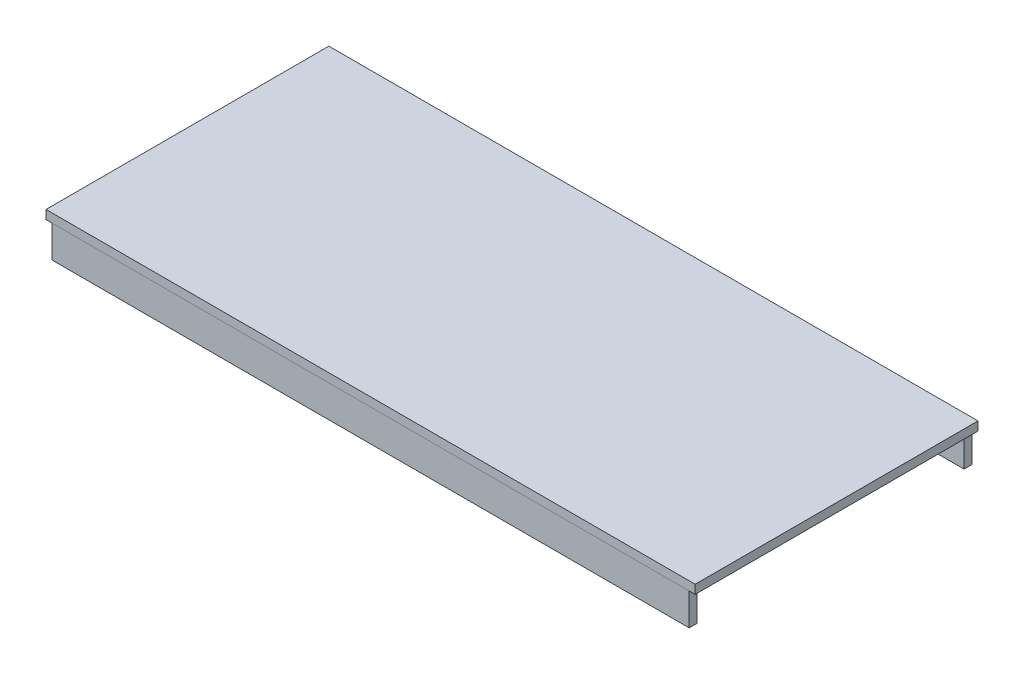
ISO-10303-21;
HEADER;
FILE_DESCRIPTION(('STEP AP214'),'2;1');
FILE_NAME('part.step','',(''),(''),'','','');
FILE_SCHEMA(('AUTOMOTIVE_DESIGN { 1 0 10303 214 1 1 1 1 }'));
ENDSEC;
DATA;
#1=APPLICATION_CONTEXT('core data for automotive mechanical design processes');
#2=APPLICATION_PROTOCOL_DEFINITION('international standard','automotive_design',2000,#1);
#3=PRODUCT_CONTEXT('',#1,'mechanical');
#4=PRODUCT('Part','Part','',(#3));
#5=PRODUCT_RELATED_PRODUCT_CATEGORY('part','',(#4));
#6=PRODUCT_DEFINITION_FORMATION('','',#4);
#7=PRODUCT_DEFINITION_CONTEXT('part definition',#1,'design');
#8=PRODUCT_DEFINITION('design','',#6,#7);
#9=PRODUCT_DEFINITION_SHAPE('','',#8);
#10=(LENGTH_UNIT() NAMED_UNIT(*) SI_UNIT(.MILLI.,.METRE.));
#11=(NAMED_UNIT(*) PLANE_ANGLE_UNIT() SI_UNIT($,.RADIAN.));
#12=(NAMED_UNIT(*) SI_UNIT($,.STERADIAN.) SOLID_ANGLE_UNIT());
#13=UNCERTAINTY_MEASURE_WITH_UNIT(LENGTH_MEASURE(1.E-05),#10,'distance_accuracy_value','');
#14=(GEOMETRIC_REPRESENTATION_CONTEXT(3) GLOBAL_UNCERTAINTY_ASSIGNED_CONTEXT((#13)) GLOBAL_UNIT_ASSIGNED_CONTEXT((#10,
#11,#12)) REPRESENTATION_CONTEXT('',''));
#15=CARTESIAN_POINT('',(0.,0.,0.));
#16=DIRECTION('',(0.,0.,1.));
#17=DIRECTION('',(1.,0.,0.));
#18=AXIS2_PLACEMENT_3D('',#15,#16,#17);
#19=CARTESIAN_POINT('',(-687.,-19.,-305.));
#20=DIRECTION('',(-1.,0.,0.));
#21=DIRECTION('',(0.,0.,1.));
#22=AXIS2_PLACEMENT_3D('',#19,#20,#21);
#23=PLANE('',#22);
#24=DIRECTION('',(0.,1.,0.));
#25=VECTOR('',#24,1.);
#26=CARTESIAN_POINT('',(-687.,-19.,-305.));
#27=LINE('',#26,#25);
#28=CARTESIAN_POINT('',(-687.,-88.,-305.));
#29=VERTEX_POINT('',#28);
#30=CARTESIAN_POINT('',(-687.,-19.,-305.));
#31=VERTEX_POINT('',#30);
#32=EDGE_CURVE('E54',#29,#31,#27,.T.);
#33=ORIENTED_EDGE('',*,*,#32,.F.);
#34=DIRECTION('',(0.,0.,-1.));
#35=VECTOR('',#34,1.);
#36=CARTESIAN_POINT('',(-687.,-88.,-305.));
#37=LINE('',#36,#35);
#38=CARTESIAN_POINT('',(-687.,-88.,-288.));
#39=VERTEX_POINT('',#38);
#40=EDGE_CURVE('E77',#39,#29,#37,.T.);
#41=ORIENTED_EDGE('',*,*,#40,.F.);
#42=DIRECTION('',(0.,-1.,0.));
#43=VECTOR('',#42,1.);
#44=CARTESIAN_POINT('',(-687.,-19.,-288.));
#45=LINE('',#44,#43);
#46=CARTESIAN_POINT('',(-687.,-19.,-288.));
#47=VERTEX_POINT('',#46);
#48=EDGE_CURVE('E82',#47,#39,#45,.T.);
#49=ORIENTED_EDGE('',*,*,#48,.F.);
#50=DIRECTION('',(0.,0.,1.));
#51=VECTOR('',#50,1.);
#52=CARTESIAN_POINT('',(-687.,-19.,-305.));
#53=LINE('',#52,#51);
#54=EDGE_CURVE('E97',#31,#47,#53,.T.);
#55=ORIENTED_EDGE('',*,*,#54,.F.);
#56=EDGE_LOOP('',(#33,#41,#49,#55));
#57=FACE_BOUND('',#56,.T.);
#58=ADVANCED_FACE('F46',(#57),#23,.T.);
#59=CARTESIAN_POINT('',(687.,-88.,-305.));
#60=DIRECTION('',(-1.,0.,0.));
#61=DIRECTION('',(0.,0.,1.));
#62=AXIS2_PLACEMENT_3D('',#59,#60,#61);
#63=PLANE('',#62);
#64=DIRECTION('',(0.,1.,0.));
#65=VECTOR('',#64,1.);
#66=CARTESIAN_POINT('',(687.,-19.,-305.));
#67=LINE('',#66,#65);
#68=CARTESIAN_POINT('',(687.,-88.,-305.));
#69=VERTEX_POINT('',#68);
#70=CARTESIAN_POINT('',(687.,-19.,-305.));
#71=VERTEX_POINT('',#70);
#72=EDGE_CURVE('E106',#69,#71,#67,.T.);
#73=ORIENTED_EDGE('',*,*,#72,.T.);
#74=DIRECTION('',(0.,0.,1.));
#75=VECTOR('',#74,1.);
#76=CARTESIAN_POINT('',(687.,-19.,-305.));
#77=LINE('',#76,#75);
#78=CARTESIAN_POINT('',(687.,-19.,-288.));
#79=VERTEX_POINT('',#78);
#80=EDGE_CURVE('E95',#71,#79,#77,.T.);
#81=ORIENTED_EDGE('',*,*,#80,.T.);
#82=DIRECTION('',(0.,-1.,0.));
#83=VECTOR('',#82,1.);
#84=CARTESIAN_POINT('',(687.,-19.,-288.));
#85=LINE('',#84,#83);
#86=CARTESIAN_POINT('',(687.,-88.,-288.));
#87=VERTEX_POINT('',#86);
#88=EDGE_CURVE('E98',#79,#87,#85,.T.);
#89=ORIENTED_EDGE('',*,*,#88,.T.);
#90=DIRECTION('',(0.,0.,-1.));
#91=VECTOR('',#90,1.);
#92=CARTESIAN_POINT('',(687.,-88.,-305.));
#93=LINE('',#92,#91);
#94=EDGE_CURVE('E103',#87,#69,#93,.T.);
#95=ORIENTED_EDGE('',*,*,#94,.T.);
#96=EDGE_LOOP('',(#73,#81,#89,#95));
#97=FACE_BOUND('',#96,.T.);
#98=ADVANCED_FACE('F105',(#97),#63,.F.);
#99=CARTESIAN_POINT('',(-771.063352017759,-19.,-305.));
#100=DIRECTION('',(0.,1.,0.));
#101=DIRECTION('',(0.,0.,1.));
#102=AXIS2_PLACEMENT_3D('',#99,#100,#101);
#103=PLANE('',#102);
#104=DIRECTION('',(1.,0.,0.));
#105=VECTOR('',#104,1.);
#106=CARTESIAN_POINT('',(-771.063352017759,-19.,-305.));
#107=LINE('',#106,#105);
#108=EDGE_CURVE('E12',#31,#71,#107,.T.);
#109=ORIENTED_EDGE('',*,*,#108,.F.);
#110=ORIENTED_EDGE('',*,*,#54,.T.);
#111=DIRECTION('',(1.,0.,0.));
#112=VECTOR('',#111,1.);
#113=CARTESIAN_POINT('',(-771.063352017759,-19.,-288.));
#114=LINE('',#113,#112);
#115=EDGE_CURVE('E92',#47,#79,#114,.T.);
#116=ORIENTED_EDGE('',*,*,#115,.T.);
#117=ORIENTED_EDGE('',*,*,#80,.F.);
#118=EDGE_LOOP('',(#109,#110,#116,#117));
#119=FACE_BOUND('',#118,.T.);
#120=ADVANCED_FACE('F93',(#119),#103,.T.);
#121=CARTESIAN_POINT('',(-771.063352017759,-19.,-288.));
#122=DIRECTION('',(0.,0.,1.));
#123=DIRECTION('',(1.,0.,0.));
#124=AXIS2_PLACEMENT_3D('',#121,#122,#123);
#125=PLANE('',#124);
#126=ORIENTED_EDGE('',*,*,#115,.F.);
#127=ORIENTED_EDGE('',*,*,#48,.T.);
#128=DIRECTION('',(1.,0.,0.));
#129=VECTOR('',#128,1.);
#130=CARTESIAN_POINT('',(-771.063352017759,-88.,-288.));
#131=LINE('',#130,#129);
#132=EDGE_CURVE('E87',#39,#87,#131,.T.);
#133=ORIENTED_EDGE('',*,*,#132,.T.);
#134=ORIENTED_EDGE('',*,*,#88,.F.);
#135=EDGE_LOOP('',(#126,#127,#133,#134));
#136=FACE_BOUND('',#135,.T.);
#137=ADVANCED_FACE('F99',(#136),#125,.T.);
#138=CARTESIAN_POINT('',(-771.063352017759,-88.,-305.));
#139=DIRECTION('',(0.,-1.,0.));
#140=DIRECTION('',(0.,0.,-1.));
#141=AXIS2_PLACEMENT_3D('',#138,#139,#140);
#142=PLANE('',#141);
#143=ORIENTED_EDGE('',*,*,#132,.F.);
#144=ORIENTED_EDGE('',*,*,#40,.T.);
#145=DIRECTION('',(1.,0.,0.));
#146=VECTOR('',#145,1.);
#147=CARTESIAN_POINT('',(-771.063352017759,-88.,-305.));
#148=LINE('',#147,#146);
#149=EDGE_CURVE('E113',#29,#69,#148,.T.);
#150=ORIENTED_EDGE('',*,*,#149,.T.);
#151=ORIENTED_EDGE('',*,*,#94,.F.);
#152=EDGE_LOOP('',(#143,#144,#150,#151));
#153=FACE_BOUND('',#152,.T.);
#154=ADVANCED_FACE('F119',(#153),#142,.T.);
#155=CARTESIAN_POINT('',(-771.063352017759,-19.,-305.));
#156=DIRECTION('',(0.,0.,-1.));
#157=DIRECTION('',(-1.,0.,0.));
#158=AXIS2_PLACEMENT_3D('',#155,#156,#157);
#159=PLANE('',#158);
#160=ORIENTED_EDGE('',*,*,#149,.F.);
#161=ORIENTED_EDGE('',*,*,#32,.T.);
#162=ORIENTED_EDGE('',*,*,#108,.T.);
#163=ORIENTED_EDGE('',*,*,#72,.F.);
#164=EDGE_LOOP('',(#160,#161,#162,#163));
#165=FACE_BOUND('',#164,.T.);
#166=ADVANCED_FACE('F120',(#165),#159,.T.);
#167=CLOSED_SHELL('',(#58,#98,#120,#137,#154,#166));
#168=MANIFOLD_SOLID_BREP('B2',#167);
#169=CARTESIAN_POINT('',(-687.,-19.,-305.));
#170=DIRECTION('',(-1.,0.,0.));
#171=DIRECTION('',(0.,0.,1.));
#172=AXIS2_PLACEMENT_3D('',#169,#170,#171);
#173=PLANE('',#172);
#174=DIRECTION('',(0.,-1.,0.));
#175=VECTOR('',#174,1.);
#176=CARTESIAN_POINT('',(-687.,-19.,305.));
#177=LINE('',#176,#175);
#178=CARTESIAN_POINT('',(-687.,-19.,305.));
#179=VERTEX_POINT('',#178);
#180=CARTESIAN_POINT('',(-687.,-88.,305.));
#181=VERTEX_POINT('',#180);
#182=EDGE_CURVE('E188',#179,#181,#177,.T.);
#183=ORIENTED_EDGE('',*,*,#182,.F.);
#184=DIRECTION('',(0.,0.,1.));
#185=VECTOR('',#184,1.);
#186=CARTESIAN_POINT('',(-687.,-19.,305.));
#187=LINE('',#186,#185);
#188=CARTESIAN_POINT('',(-687.,-19.,288.));
#189=VERTEX_POINT('',#188);
#190=EDGE_CURVE('E211',#189,#179,#187,.T.);
#191=ORIENTED_EDGE('',*,*,#190,.F.);
#192=DIRECTION('',(0.,1.,0.));
#193=VECTOR('',#192,1.);
#194=CARTESIAN_POINT('',(-687.,-19.,288.));
#195=LINE('',#194,#193);
#196=CARTESIAN_POINT('',(-687.,-88.,288.));
#197=VERTEX_POINT('',#196);
#198=EDGE_CURVE('E216',#197,#189,#195,.T.);
#199=ORIENTED_EDGE('',*,*,#198,.F.);
#200=DIRECTION('',(0.,0.,-1.));
#201=VECTOR('',#200,1.);
#202=CARTESIAN_POINT('',(-687.,-88.,305.));
#203=LINE('',#202,#201);
#204=EDGE_CURVE('E231',#181,#197,#203,.T.);
#205=ORIENTED_EDGE('',*,*,#204,.F.);
#206=EDGE_LOOP('',(#183,#191,#199,#205));
#207=FACE_BOUND('',#206,.T.);
#208=ADVANCED_FACE('F180',(#207),#173,.T.);
#209=CARTESIAN_POINT('',(687.,-88.,305.));
#210=DIRECTION('',(1.,0.,0.));
#211=DIRECTION('',(0.,0.,-1.));
#212=AXIS2_PLACEMENT_3D('',#209,#210,#211);
#213=PLANE('',#212);
#214=DIRECTION('',(0.,-1.,0.));
#215=VECTOR('',#214,1.);
#216=CARTESIAN_POINT('',(687.,-19.,305.));
#217=LINE('',#216,#215);
#218=CARTESIAN_POINT('',(687.,-19.,305.));
#219=VERTEX_POINT('',#218);
#220=CARTESIAN_POINT('',(687.,-88.,305.));
#221=VERTEX_POINT('',#220);
#222=EDGE_CURVE('E240',#219,#221,#217,.T.);
#223=ORIENTED_EDGE('',*,*,#222,.T.);
#224=DIRECTION('',(0.,0.,-1.));
#225=VECTOR('',#224,1.);
#226=CARTESIAN_POINT('',(687.,-88.,305.));
#227=LINE('',#226,#225);
#228=CARTESIAN_POINT('',(687.,-88.,288.));
#229=VERTEX_POINT('',#228);
#230=EDGE_CURVE('E229',#221,#229,#227,.T.);
#231=ORIENTED_EDGE('',*,*,#230,.T.);
#232=DIRECTION('',(0.,1.,0.));
#233=VECTOR('',#232,1.);
#234=CARTESIAN_POINT('',(687.,-19.,288.));
#235=LINE('',#234,#233);
#236=CARTESIAN_POINT('',(687.,-19.,288.));
#237=VERTEX_POINT('',#236);
#238=EDGE_CURVE('E232',#229,#237,#235,.T.);
#239=ORIENTED_EDGE('',*,*,#238,.T.);
#240=DIRECTION('',(0.,0.,1.));
#241=VECTOR('',#240,1.);
#242=CARTESIAN_POINT('',(687.,-19.,305.));
#243=LINE('',#242,#241);
#244=EDGE_CURVE('E237',#237,#219,#243,.T.);
#245=ORIENTED_EDGE('',*,*,#244,.T.);
#246=EDGE_LOOP('',(#223,#231,#239,#245));
#247=FACE_BOUND('',#246,.T.);
#248=ADVANCED_FACE('F239',(#247),#213,.T.);
#249=CARTESIAN_POINT('',(-771.063352017759,-88.,305.));
#250=DIRECTION('',(0.,-1.,0.));
#251=DIRECTION('',(0.,0.,-1.));
#252=AXIS2_PLACEMENT_3D('',#249,#250,#251);
#253=PLANE('',#252);
#254=DIRECTION('',(1.,0.,0.));
#255=VECTOR('',#254,1.);
#256=CARTESIAN_POINT('',(-771.063352017759,-88.,305.));
#257=LINE('',#256,#255);
#258=EDGE_CURVE('E44',#181,#221,#257,.T.);
#259=ORIENTED_EDGE('',*,*,#258,.F.);
#260=ORIENTED_EDGE('',*,*,#204,.T.);
#261=DIRECTION('',(1.,0.,0.));
#262=VECTOR('',#261,1.);
#263=CARTESIAN_POINT('',(-771.063352017759,-88.,288.));
#264=LINE('',#263,#262);
#265=EDGE_CURVE('E226',#197,#229,#264,.T.);
#266=ORIENTED_EDGE('',*,*,#265,.T.);
#267=ORIENTED_EDGE('',*,*,#230,.F.);
#268=EDGE_LOOP('',(#259,#260,#266,#267));
#269=FACE_BOUND('',#268,.T.);
#270=ADVANCED_FACE('F227',(#269),#253,.T.);
#271=CARTESIAN_POINT('',(-771.063352017759,-19.,288.));
#272=DIRECTION('',(0.,0.,-1.));
#273=DIRECTION('',(-1.,0.,0.));
#274=AXIS2_PLACEMENT_3D('',#271,#272,#273);
#275=PLANE('',#274);
#276=ORIENTED_EDGE('',*,*,#265,.F.);
#277=ORIENTED_EDGE('',*,*,#198,.T.);
#278=DIRECTION('',(1.,0.,0.));
#279=VECTOR('',#278,1.);
#280=CARTESIAN_POINT('',(-771.063352017759,-19.,288.));
#281=LINE('',#280,#279);
#282=EDGE_CURVE('E221',#189,#237,#281,.T.);
#283=ORIENTED_EDGE('',*,*,#282,.T.);
#284=ORIENTED_EDGE('',*,*,#238,.F.);
#285=EDGE_LOOP('',(#276,#277,#283,#284));
#286=FACE_BOUND('',#285,.T.);
#287=ADVANCED_FACE('F233',(#286),#275,.T.);
#288=CARTESIAN_POINT('',(-771.063352017759,-19.,305.));
#289=DIRECTION('',(0.,1.,0.));
#290=DIRECTION('',(0.,0.,1.));
#291=AXIS2_PLACEMENT_3D('',#288,#289,#290);
#292=PLANE('',#291);
#293=ORIENTED_EDGE('',*,*,#282,.F.);
#294=ORIENTED_EDGE('',*,*,#190,.T.);
#295=DIRECTION('',(1.,0.,0.));
#296=VECTOR('',#295,1.);
#297=CARTESIAN_POINT('',(-771.063352017759,-19.,305.));
#298=LINE('',#297,#296);
#299=EDGE_CURVE('E247',#179,#219,#298,.T.);
#300=ORIENTED_EDGE('',*,*,#299,.T.);
#301=ORIENTED_EDGE('',*,*,#244,.F.);
#302=EDGE_LOOP('',(#293,#294,#300,#301));
#303=FACE_BOUND('',#302,.T.);
#304=ADVANCED_FACE('F253',(#303),#292,.T.);
#305=CARTESIAN_POINT('',(-771.063352017759,-19.,305.));
#306=DIRECTION('',(0.,0.,1.));
#307=DIRECTION('',(1.,0.,0.));
#308=AXIS2_PLACEMENT_3D('',#305,#306,#307);
#309=PLANE('',#308);
#310=ORIENTED_EDGE('',*,*,#299,.F.);
#311=ORIENTED_EDGE('',*,*,#182,.T.);
#312=ORIENTED_EDGE('',*,*,#258,.T.);
#313=ORIENTED_EDGE('',*,*,#222,.F.);
#314=EDGE_LOOP('',(#310,#311,#312,#313));
#315=FACE_BOUND('',#314,.T.);
#316=ADVANCED_FACE('F254',(#315),#309,.T.);
#317=CLOSED_SHELL('',(#208,#248,#270,#287,#304,#316));
#318=MANIFOLD_SOLID_BREP('B6',#317);
#319=CARTESIAN_POINT('',(-700.,-19.,-305.));
#320=DIRECTION('',(-1.,0.,0.));
#321=DIRECTION('',(0.,0.,1.));
#322=AXIS2_PLACEMENT_3D('',#319,#320,#321);
#323=PLANE('',#322);
#324=DIRECTION('',(0.,0.,1.));
#325=VECTOR('',#324,1.);
#326=CARTESIAN_POINT('',(-700.,0.,-305.));
#327=LINE('',#326,#325);
#328=CARTESIAN_POINT('',(-700.,0.,-305.));
#329=VERTEX_POINT('',#328);
#330=CARTESIAN_POINT('',(-700.,0.,305.));
#331=VERTEX_POINT('',#330);
#332=EDGE_CURVE('E368',#329,#331,#327,.T.);
#333=ORIENTED_EDGE('',*,*,#332,.F.);
#334=DIRECTION('',(0.,1.,0.));
#335=VECTOR('',#334,1.);
#336=CARTESIAN_POINT('',(-700.,-19.,-305.));
#337=LINE('',#336,#335);
#338=CARTESIAN_POINT('',(-700.,-19.,-305.));
#339=VERTEX_POINT('',#338);
#340=EDGE_CURVE('E178',#339,#329,#337,.T.);
#341=ORIENTED_EDGE('',*,*,#340,.F.);
#342=DIRECTION('',(0.,0.,1.));
#343=VECTOR('',#342,1.);
#344=CARTESIAN_POINT('',(-700.,-19.,-305.));
#345=LINE('',#344,#343);
#346=CARTESIAN_POINT('',(-700.,-19.,305.));
#347=VERTEX_POINT('',#346);
#348=EDGE_CURVE('E362',#339,#347,#345,.T.);
#349=ORIENTED_EDGE('',*,*,#348,.T.);
#350=DIRECTION('',(0.,1.,0.));
#351=VECTOR('',#350,1.);
#352=CARTESIAN_POINT('',(-700.,-19.,305.));
#353=LINE('',#352,#351);
#354=EDGE_CURVE('E307',#347,#331,#353,.T.);
#355=ORIENTED_EDGE('',*,*,#354,.T.);
#356=EDGE_LOOP('',(#333,#341,#349,#355));
#357=FACE_BOUND('',#356,.T.);
#358=ADVANCED_FACE('F304',(#357),#323,.T.);
#359=CARTESIAN_POINT('',(-700.,-19.,-305.));
#360=DIRECTION('',(0.,0.,-1.));
#361=DIRECTION('',(-1.,0.,0.));
#362=AXIS2_PLACEMENT_3D('',#359,#360,#361);
#363=PLANE('',#362);
#364=DIRECTION('',(-1.,0.,0.));
#365=VECTOR('',#364,1.);
#366=CARTESIAN_POINT('',(-700.,0.,-305.));
#367=LINE('',#366,#365);
#368=CARTESIAN_POINT('',(700.,0.,-305.));
#369=VERTEX_POINT('',#368);
#370=EDGE_CURVE('E364',#369,#329,#367,.T.);
#371=ORIENTED_EDGE('',*,*,#370,.F.);
#372=DIRECTION('',(0.,1.,0.));
#373=VECTOR('',#372,1.);
#374=CARTESIAN_POINT('',(700.,-19.,-305.));
#375=LINE('',#374,#373);
#376=CARTESIAN_POINT('',(700.,-19.,-305.));
#377=VERTEX_POINT('',#376);
#378=EDGE_CURVE('E313',#377,#369,#375,.T.);
#379=ORIENTED_EDGE('',*,*,#378,.F.);
#380=DIRECTION('',(-1.,0.,0.));
#381=VECTOR('',#380,1.);
#382=CARTESIAN_POINT('',(-700.,-19.,-305.));
#383=LINE('',#382,#381);
#384=EDGE_CURVE('E359',#377,#339,#383,.T.);
#385=ORIENTED_EDGE('',*,*,#384,.T.);
#386=ORIENTED_EDGE('',*,*,#340,.T.);
#387=EDGE_LOOP('',(#371,#379,#385,#386));
#388=FACE_BOUND('',#387,.T.);
#389=ADVANCED_FACE('F378',(#388),#363,.T.);
#390=CARTESIAN_POINT('',(700.,-19.,-305.));
#391=DIRECTION('',(1.,0.,0.));
#392=DIRECTION('',(0.,0.,-1.));
#393=AXIS2_PLACEMENT_3D('',#390,#391,#392);
#394=PLANE('',#393);
#395=DIRECTION('',(0.,0.,-1.));
#396=VECTOR('',#395,1.);
#397=CARTESIAN_POINT('',(700.,0.,-305.));
#398=LINE('',#397,#396);
#399=CARTESIAN_POINT('',(700.,0.,305.));
#400=VERTEX_POINT('',#399);
#401=EDGE_CURVE('E354',#400,#369,#398,.T.);
#402=ORIENTED_EDGE('',*,*,#401,.F.);
#403=DIRECTION('',(0.,1.,0.));
#404=VECTOR('',#403,1.);
#405=CARTESIAN_POINT('',(700.,-19.,305.));
#406=LINE('',#405,#404);
#407=CARTESIAN_POINT('',(700.,-19.,305.));
#408=VERTEX_POINT('',#407);
#409=EDGE_CURVE('E349',#408,#400,#406,.T.);
#410=ORIENTED_EDGE('',*,*,#409,.F.);
#411=DIRECTION('',(0.,0.,-1.));
#412=VECTOR('',#411,1.);
#413=CARTESIAN_POINT('',(700.,-19.,-305.));
#414=LINE('',#413,#412);
#415=EDGE_CURVE('E352',#408,#377,#414,.T.);
#416=ORIENTED_EDGE('',*,*,#415,.T.);
#417=ORIENTED_EDGE('',*,*,#378,.T.);
#418=EDGE_LOOP('',(#402,#410,#416,#417));
#419=FACE_BOUND('',#418,.T.);
#420=ADVANCED_FACE('F351',(#419),#394,.T.);
#421=CARTESIAN_POINT('',(-700.,-19.,305.));
#422=DIRECTION('',(0.,0.,1.));
#423=DIRECTION('',(1.,0.,0.));
#424=AXIS2_PLACEMENT_3D('',#421,#422,#423);
#425=PLANE('',#424);
#426=DIRECTION('',(1.,0.,0.));
#427=VECTOR('',#426,1.);
#428=CARTESIAN_POINT('',(-700.,0.,305.));
#429=LINE('',#428,#427);
#430=EDGE_CURVE('E371',#331,#400,#429,.T.);
#431=ORIENTED_EDGE('',*,*,#430,.F.);
#432=ORIENTED_EDGE('',*,*,#354,.F.);
#433=DIRECTION('',(1.,0.,0.));
#434=VECTOR('',#433,1.);
#435=CARTESIAN_POINT('',(-700.,-19.,305.));
#436=LINE('',#435,#434);
#437=EDGE_CURVE('E358',#347,#408,#436,.T.);
#438=ORIENTED_EDGE('',*,*,#437,.T.);
#439=ORIENTED_EDGE('',*,*,#409,.T.);
#440=EDGE_LOOP('',(#431,#432,#438,#439));
#441=FACE_BOUND('',#440,.T.);
#442=ADVANCED_FACE('F361',(#441),#425,.T.);
#443=CARTESIAN_POINT('',(-700.,-19.,305.));
#444=DIRECTION('',(0.,1.,0.));
#445=DIRECTION('',(0.,0.,1.));
#446=AXIS2_PLACEMENT_3D('',#443,#444,#445);
#447=PLANE('',#446);
#448=ORIENTED_EDGE('',*,*,#348,.F.);
#449=ORIENTED_EDGE('',*,*,#384,.F.);
#450=ORIENTED_EDGE('',*,*,#415,.F.);
#451=ORIENTED_EDGE('',*,*,#437,.F.);
#452=EDGE_LOOP('',(#448,#449,#450,#451));
#453=FACE_BOUND('',#452,.T.);
#454=ADVANCED_FACE('F357',(#453),#447,.F.);
#455=CARTESIAN_POINT('',(-700.,0.,305.));
#456=DIRECTION('',(0.,1.,0.));
#457=DIRECTION('',(0.,0.,1.));
#458=AXIS2_PLACEMENT_3D('',#455,#456,#457);
#459=PLANE('',#458);
#460=ORIENTED_EDGE('',*,*,#332,.T.);
#461=ORIENTED_EDGE('',*,*,#430,.T.);
#462=ORIENTED_EDGE('',*,*,#401,.T.);
#463=ORIENTED_EDGE('',*,*,#370,.T.);
#464=EDGE_LOOP('',(#460,#461,#462,#463));
#465=FACE_BOUND('',#464,.T.);
#466=ADVANCED_FACE('F377',(#465),#459,.T.);
#467=CLOSED_SHELL('',(#358,#389,#420,#442,#454,#466));
#468=MANIFOLD_SOLID_BREP('B38',#467);
#469=ADVANCED_BREP_SHAPE_REPRESENTATION('',(#18,#168,#318,#468),#14);
#470=SHAPE_DEFINITION_REPRESENTATION(#9,#469);
ENDSEC;
END-ISO-10303-21;
